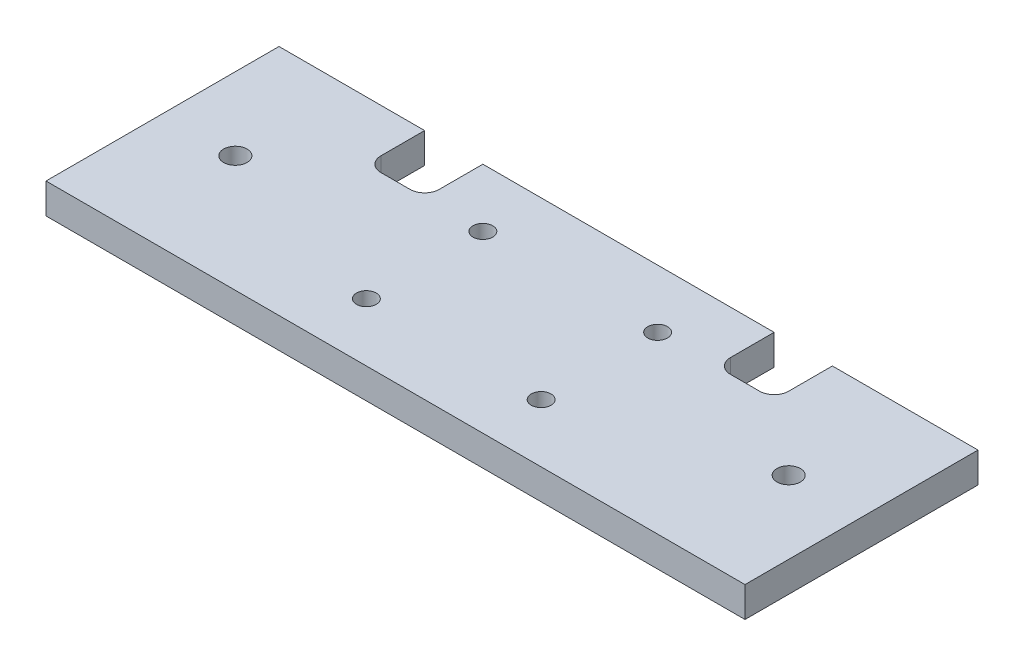
ISO-10303-21;
HEADER;
FILE_DESCRIPTION(('STEP AP214'),'2;1');
FILE_NAME('part.step','',(''),(''),'','','');
FILE_SCHEMA(('AUTOMOTIVE_DESIGN { 1 0 10303 214 1 1 1 1 }'));
ENDSEC;
DATA;
#1=APPLICATION_CONTEXT('core data for automotive mechanical design processes');
#2=APPLICATION_PROTOCOL_DEFINITION('international standard','automotive_design',2000,#1);
#3=PRODUCT_CONTEXT('',#1,'mechanical');
#4=PRODUCT('Part','Part','',(#3));
#5=PRODUCT_RELATED_PRODUCT_CATEGORY('part','',(#4));
#6=PRODUCT_DEFINITION_FORMATION('','',#4);
#7=PRODUCT_DEFINITION_CONTEXT('part definition',#1,'design');
#8=PRODUCT_DEFINITION('design','',#6,#7);
#9=PRODUCT_DEFINITION_SHAPE('','',#8);
#10=(LENGTH_UNIT() NAMED_UNIT(*) SI_UNIT(.MILLI.,.METRE.));
#11=(NAMED_UNIT(*) PLANE_ANGLE_UNIT() SI_UNIT($,.RADIAN.));
#12=(NAMED_UNIT(*) SI_UNIT($,.STERADIAN.) SOLID_ANGLE_UNIT());
#13=UNCERTAINTY_MEASURE_WITH_UNIT(LENGTH_MEASURE(1.E-05),#10,'distance_accuracy_value','');
#14=(GEOMETRIC_REPRESENTATION_CONTEXT(3) GLOBAL_UNCERTAINTY_ASSIGNED_CONTEXT((#13)) GLOBAL_UNIT_ASSIGNED_CONTEXT((#10,
#11,#12)) REPRESENTATION_CONTEXT('',''));
#15=CARTESIAN_POINT('',(0.,0.,0.));
#16=DIRECTION('',(0.,0.,1.));
#17=DIRECTION('',(1.,0.,0.));
#18=AXIS2_PLACEMENT_3D('',#15,#16,#17);
#19=CARTESIAN_POINT('',(-76.2,6.604,-25.4));
#20=DIRECTION('',(0.,0.,1.));
#21=DIRECTION('',(1.,0.,0.));
#22=AXIS2_PLACEMENT_3D('',#19,#20,#21);
#23=PLANE('',#22);
#24=DIRECTION('',(0.,1.,0.));
#25=VECTOR('',#24,1.);
#26=CARTESIAN_POINT('',(44.45,0.,-25.4));
#27=LINE('',#26,#25);
#28=CARTESIAN_POINT('',(44.45,0.,-25.4));
#29=VERTEX_POINT('',#28);
#30=CARTESIAN_POINT('',(44.45,6.604,-25.4));
#31=VERTEX_POINT('',#30);
#32=EDGE_CURVE('E148',#29,#31,#27,.T.);
#33=ORIENTED_EDGE('',*,*,#32,.T.);
#34=DIRECTION('',(-1.,0.,0.));
#35=VECTOR('',#34,1.);
#36=CARTESIAN_POINT('',(-76.2,6.604,-25.4));
#37=LINE('',#36,#35);
#38=CARTESIAN_POINT('',(76.2,6.604,-25.4));
#39=VERTEX_POINT('',#38);
#40=EDGE_CURVE('E200',#39,#31,#37,.T.);
#41=ORIENTED_EDGE('',*,*,#40,.F.);
#42=DIRECTION('',(0.,-1.,0.));
#43=VECTOR('',#42,1.);
#44=CARTESIAN_POINT('',(76.2,6.604,-25.4));
#45=LINE('',#44,#43);
#46=CARTESIAN_POINT('',(76.2,0.,-25.4));
#47=VERTEX_POINT('',#46);
#48=EDGE_CURVE('E175',#39,#47,#45,.T.);
#49=ORIENTED_EDGE('',*,*,#48,.T.);
#50=DIRECTION('',(-1.,0.,0.));
#51=VECTOR('',#50,1.);
#52=CARTESIAN_POINT('',(-76.2,0.,-25.4));
#53=LINE('',#52,#51);
#54=EDGE_CURVE('E168',#47,#29,#53,.T.);
#55=ORIENTED_EDGE('',*,*,#54,.T.);
#56=EDGE_LOOP('',(#33,#41,#49,#55));
#57=FACE_BOUND('',#56,.T.);
#58=ADVANCED_FACE('F34',(#57),#23,.F.);
#59=DIRECTION('',(0.,1.,0.));
#60=VECTOR('',#59,1.);
#61=CARTESIAN_POINT('',(31.75,0.,-25.4));
#62=LINE('',#61,#60);
#63=CARTESIAN_POINT('',(31.75,0.,-25.4));
#64=VERTEX_POINT('',#63);
#65=CARTESIAN_POINT('',(31.75,6.604,-25.4));
#66=VERTEX_POINT('',#65);
#67=EDGE_CURVE('E160',#64,#66,#62,.T.);
#68=ORIENTED_EDGE('',*,*,#67,.F.);
#69=CARTESIAN_POINT('',(-31.75,0.,-25.4));
#70=VERTEX_POINT('',#69);
#71=EDGE_CURVE('E177',#64,#70,#53,.T.);
#72=ORIENTED_EDGE('',*,*,#71,.T.);
#73=DIRECTION('',(0.,1.,0.));
#74=VECTOR('',#73,1.);
#75=CARTESIAN_POINT('',(-31.75,0.,-25.4));
#76=LINE('',#75,#74);
#77=CARTESIAN_POINT('',(-31.75,6.604,-25.4));
#78=VERTEX_POINT('',#77);
#79=EDGE_CURVE('E217',#70,#78,#76,.T.);
#80=ORIENTED_EDGE('',*,*,#79,.T.);
#81=EDGE_CURVE('E203',#66,#78,#37,.T.);
#82=ORIENTED_EDGE('',*,*,#81,.F.);
#83=EDGE_LOOP('',(#68,#72,#80,#82));
#84=FACE_BOUND('',#83,.T.);
#85=ADVANCED_FACE('F318',(#84),#23,.F.);
#86=CARTESIAN_POINT('',(0.,6.604,0.));
#87=DIRECTION('',(0.,1.,0.));
#88=DIRECTION('',(0.,0.,1.));
#89=AXIS2_PLACEMENT_3D('',#86,#87,#88);
#90=PLANE('',#89);
#91=CARTESIAN_POINT('',(-19.05,6.604,-12.7));
#92=DIRECTION('',(0.,1.,0.));
#93=DIRECTION('',(0.,0.,1.));
#94=AXIS2_PLACEMENT_3D('',#91,#92,#93);
#95=CIRCLE('',#94,2.15265);
#96=CARTESIAN_POINT('',(-19.05,6.604,-10.54735));
#97=VERTEX_POINT('',#96);
#98=EDGE_CURVE('E298',#97,#97,#95,.T.);
#99=ORIENTED_EDGE('',*,*,#98,.F.);
#100=EDGE_LOOP('',(#99));
#101=FACE_BOUND('',#100,.T.);
#102=CARTESIAN_POINT('',(-19.05,6.604,12.7));
#103=DIRECTION('',(0.,1.,0.));
#104=DIRECTION('',(0.,0.,1.));
#105=AXIS2_PLACEMENT_3D('',#102,#103,#104);
#106=CIRCLE('',#105,2.15265);
#107=CARTESIAN_POINT('',(-19.05,6.604,14.85265));
#108=VERTEX_POINT('',#107);
#109=EDGE_CURVE('E295',#108,#108,#106,.T.);
#110=ORIENTED_EDGE('',*,*,#109,.F.);
#111=EDGE_LOOP('',(#110));
#112=FACE_BOUND('',#111,.T.);
#113=CARTESIAN_POINT('',(19.05,6.604,-12.7));
#114=DIRECTION('',(0.,1.,0.));
#115=DIRECTION('',(0.,0.,1.));
#116=AXIS2_PLACEMENT_3D('',#113,#114,#115);
#117=CIRCLE('',#116,2.15265);
#118=CARTESIAN_POINT('',(19.05,6.604,-10.54735));
#119=VERTEX_POINT('',#118);
#120=EDGE_CURVE('E291',#119,#119,#117,.T.);
#121=ORIENTED_EDGE('',*,*,#120,.F.);
#122=EDGE_LOOP('',(#121));
#123=FACE_BOUND('',#122,.T.);
#124=CARTESIAN_POINT('',(19.05,6.604,12.7));
#125=DIRECTION('',(0.,1.,0.));
#126=DIRECTION('',(0.,0.,1.));
#127=AXIS2_PLACEMENT_3D('',#124,#125,#126);
#128=CIRCLE('',#127,2.15265);
#129=CARTESIAN_POINT('',(19.05,6.604,14.85265));
#130=VERTEX_POINT('',#129);
#131=EDGE_CURVE('E287',#130,#130,#128,.T.);
#132=ORIENTED_EDGE('',*,*,#131,.F.);
#133=EDGE_LOOP('',(#132));
#134=FACE_BOUND('',#133,.T.);
#135=CARTESIAN_POINT('',(-60.325,6.604,0.));
#136=DIRECTION('',(0.,1.,0.));
#137=DIRECTION('',(0.,0.,1.));
#138=AXIS2_PLACEMENT_3D('',#135,#136,#137);
#139=CIRCLE('',#138,2.5527);
#140=CARTESIAN_POINT('',(-60.325,6.604,2.5527));
#141=VERTEX_POINT('',#140);
#142=EDGE_CURVE('E281',#141,#141,#139,.T.);
#143=ORIENTED_EDGE('',*,*,#142,.F.);
#144=EDGE_LOOP('',(#143));
#145=FACE_BOUND('',#144,.T.);
#146=CARTESIAN_POINT('',(60.325,6.604,0.));
#147=DIRECTION('',(0.,1.,0.));
#148=DIRECTION('',(0.,0.,1.));
#149=AXIS2_PLACEMENT_3D('',#146,#147,#148);
#150=CIRCLE('',#149,2.5527);
#151=CARTESIAN_POINT('',(60.325,6.604,2.5527));
#152=VERTEX_POINT('',#151);
#153=EDGE_CURVE('E277',#152,#152,#150,.T.);
#154=ORIENTED_EDGE('',*,*,#153,.F.);
#155=EDGE_LOOP('',(#154));
#156=FACE_BOUND('',#155,.T.);
#157=ORIENTED_EDGE('',*,*,#40,.T.);
#158=DIRECTION('',(0.,0.,1.));
#159=VECTOR('',#158,1.);
#160=CARTESIAN_POINT('',(44.45,6.604,-25.4));
#161=LINE('',#160,#159);
#162=CARTESIAN_POINT('',(44.45,6.604,-15.875));
#163=VERTEX_POINT('',#162);
#164=EDGE_CURVE('E155',#31,#163,#161,.T.);
#165=ORIENTED_EDGE('',*,*,#164,.T.);
#166=CARTESIAN_POINT('',(41.275,6.604,-15.875));
#167=DIRECTION('',(0.,-1.,0.));
#168=DIRECTION('',(0.,0.,1.));
#169=AXIS2_PLACEMENT_3D('',#166,#167,#168);
#170=CIRCLE('',#169,3.175);
#171=CARTESIAN_POINT('',(41.275,6.604,-12.7));
#172=VERTEX_POINT('',#171);
#173=EDGE_CURVE('E171',#163,#172,#170,.T.);
#174=ORIENTED_EDGE('',*,*,#173,.T.);
#175=DIRECTION('',(-1.,0.,0.));
#176=VECTOR('',#175,1.);
#177=CARTESIAN_POINT('',(41.275,6.604,-12.7));
#178=LINE('',#177,#176);
#179=CARTESIAN_POINT('',(34.925,6.604,-12.7));
#180=VERTEX_POINT('',#179);
#181=EDGE_CURVE('E258',#172,#180,#178,.T.);
#182=ORIENTED_EDGE('',*,*,#181,.T.);
#183=CARTESIAN_POINT('',(34.925,6.604,-15.875));
#184=DIRECTION('',(0.,-1.,0.));
#185=DIRECTION('',(0.,0.,-1.));
#186=AXIS2_PLACEMENT_3D('',#183,#184,#185);
#187=CIRCLE('',#186,3.175);
#188=CARTESIAN_POINT('',(31.75,6.604,-15.875));
#189=VERTEX_POINT('',#188);
#190=EDGE_CURVE('E261',#180,#189,#187,.T.);
#191=ORIENTED_EDGE('',*,*,#190,.T.);
#192=DIRECTION('',(0.,0.,-1.));
#193=VECTOR('',#192,1.);
#194=CARTESIAN_POINT('',(31.75,6.604,-25.4));
#195=LINE('',#194,#193);
#196=EDGE_CURVE('E264',#189,#66,#195,.T.);
#197=ORIENTED_EDGE('',*,*,#196,.T.);
#198=ORIENTED_EDGE('',*,*,#81,.T.);
#199=DIRECTION('',(0.,0.,-1.));
#200=VECTOR('',#199,1.);
#201=CARTESIAN_POINT('',(-31.75,6.604,-25.4));
#202=LINE('',#201,#200);
#203=CARTESIAN_POINT('',(-31.75,6.604,-15.875));
#204=VERTEX_POINT('',#203);
#205=EDGE_CURVE('E221',#204,#78,#202,.T.);
#206=ORIENTED_EDGE('',*,*,#205,.F.);
#207=CARTESIAN_POINT('',(-34.925,6.604,-15.875));
#208=DIRECTION('',(0.,1.,0.));
#209=DIRECTION('',(0.,0.,-1.));
#210=AXIS2_PLACEMENT_3D('',#207,#208,#209);
#211=CIRCLE('',#210,3.175);
#212=CARTESIAN_POINT('',(-34.925,6.604,-12.7));
#213=VERTEX_POINT('',#212);
#214=EDGE_CURVE('E225',#213,#204,#211,.T.);
#215=ORIENTED_EDGE('',*,*,#214,.F.);
#216=DIRECTION('',(1.,0.,0.));
#217=VECTOR('',#216,1.);
#218=CARTESIAN_POINT('',(-41.275,6.604,-12.7));
#219=LINE('',#218,#217);
#220=CARTESIAN_POINT('',(-41.275,6.604,-12.7));
#221=VERTEX_POINT('',#220);
#222=EDGE_CURVE('E228',#221,#213,#219,.T.);
#223=ORIENTED_EDGE('',*,*,#222,.F.);
#224=CARTESIAN_POINT('',(-41.275,6.604,-15.875));
#225=DIRECTION('',(0.,1.,0.));
#226=DIRECTION('',(0.,0.,1.));
#227=AXIS2_PLACEMENT_3D('',#224,#225,#226);
#228=CIRCLE('',#227,3.175);
#229=CARTESIAN_POINT('',(-44.45,6.604,-15.875));
#230=VERTEX_POINT('',#229);
#231=EDGE_CURVE('E231',#230,#221,#228,.T.);
#232=ORIENTED_EDGE('',*,*,#231,.F.);
#233=DIRECTION('',(0.,0.,1.));
#234=VECTOR('',#233,1.);
#235=CARTESIAN_POINT('',(-44.45,6.604,-25.4));
#236=LINE('',#235,#234);
#237=CARTESIAN_POINT('',(-44.45,6.604,-25.4));
#238=VERTEX_POINT('',#237);
#239=EDGE_CURVE('E234',#238,#230,#236,.T.);
#240=ORIENTED_EDGE('',*,*,#239,.F.);
#241=CARTESIAN_POINT('',(-76.2,6.604,-25.4));
#242=VERTEX_POINT('',#241);
#243=EDGE_CURVE('E204',#238,#242,#37,.T.);
#244=ORIENTED_EDGE('',*,*,#243,.T.);
#245=DIRECTION('',(0.,0.,1.));
#246=VECTOR('',#245,1.);
#247=CARTESIAN_POINT('',(-76.2,6.604,-25.4));
#248=LINE('',#247,#246);
#249=CARTESIAN_POINT('',(-76.2,6.604,25.4));
#250=VERTEX_POINT('',#249);
#251=EDGE_CURVE('E176',#242,#250,#248,.T.);
#252=ORIENTED_EDGE('',*,*,#251,.T.);
#253=DIRECTION('',(1.,0.,0.));
#254=VECTOR('',#253,1.);
#255=CARTESIAN_POINT('',(-76.2,6.604,25.4));
#256=LINE('',#255,#254);
#257=CARTESIAN_POINT('',(76.2,6.604,25.4));
#258=VERTEX_POINT('',#257);
#259=EDGE_CURVE('E181',#250,#258,#256,.T.);
#260=ORIENTED_EDGE('',*,*,#259,.T.);
#261=DIRECTION('',(0.,0.,-1.));
#262=VECTOR('',#261,1.);
#263=CARTESIAN_POINT('',(76.2,6.604,-25.4));
#264=LINE('',#263,#262);
#265=EDGE_CURVE('E205',#258,#39,#264,.T.);
#266=ORIENTED_EDGE('',*,*,#265,.T.);
#267=EDGE_LOOP('',(#157,#165,#174,#182,#191,#197,#198,#206,#215,#223,#232,#240,#244,#252,#260,#266));
#268=FACE_BOUND('',#267,.T.);
#269=ADVANCED_FACE('F324',(#101,#112,#123,#134,#145,#156,#268),#90,.T.);
#270=CARTESIAN_POINT('',(0.,0.,0.));
#271=DIRECTION('',(0.,1.,0.));
#272=DIRECTION('',(0.,0.,1.));
#273=AXIS2_PLACEMENT_3D('',#270,#271,#272);
#274=PLANE('',#273);
#275=CARTESIAN_POINT('',(-19.05,0.,-12.7));
#276=DIRECTION('',(0.,1.,0.));
#277=DIRECTION('',(0.,0.,1.));
#278=AXIS2_PLACEMENT_3D('',#275,#276,#277);
#279=CIRCLE('',#278,2.15265);
#280=CARTESIAN_POINT('',(-19.05,0.,-10.54735));
#281=VERTEX_POINT('',#280);
#282=EDGE_CURVE('E38',#281,#281,#279,.T.);
#283=ORIENTED_EDGE('',*,*,#282,.T.);
#284=EDGE_LOOP('',(#283));
#285=FACE_BOUND('',#284,.T.);
#286=CARTESIAN_POINT('',(-19.05,0.,12.7));
#287=DIRECTION('',(0.,1.,0.));
#288=DIRECTION('',(0.,0.,1.));
#289=AXIS2_PLACEMENT_3D('',#286,#287,#288);
#290=CIRCLE('',#289,2.15265);
#291=CARTESIAN_POINT('',(-19.05,0.,14.85265));
#292=VERTEX_POINT('',#291);
#293=EDGE_CURVE('E294',#292,#292,#290,.T.);
#294=ORIENTED_EDGE('',*,*,#293,.T.);
#295=EDGE_LOOP('',(#294));
#296=FACE_BOUND('',#295,.T.);
#297=CARTESIAN_POINT('',(19.05,0.,-12.7));
#298=DIRECTION('',(0.,1.,0.));
#299=DIRECTION('',(0.,0.,1.));
#300=AXIS2_PLACEMENT_3D('',#297,#298,#299);
#301=CIRCLE('',#300,2.15265);
#302=CARTESIAN_POINT('',(19.05,0.,-10.54735));
#303=VERTEX_POINT('',#302);
#304=EDGE_CURVE('E290',#303,#303,#301,.T.);
#305=ORIENTED_EDGE('',*,*,#304,.T.);
#306=EDGE_LOOP('',(#305));
#307=FACE_BOUND('',#306,.T.);
#308=CARTESIAN_POINT('',(19.05,0.,12.7));
#309=DIRECTION('',(0.,1.,0.));
#310=DIRECTION('',(0.,0.,1.));
#311=AXIS2_PLACEMENT_3D('',#308,#309,#310);
#312=CIRCLE('',#311,2.15265);
#313=CARTESIAN_POINT('',(19.05,0.,14.85265));
#314=VERTEX_POINT('',#313);
#315=EDGE_CURVE('E284',#314,#314,#312,.T.);
#316=ORIENTED_EDGE('',*,*,#315,.T.);
#317=EDGE_LOOP('',(#316));
#318=FACE_BOUND('',#317,.T.);
#319=CARTESIAN_POINT('',(-60.325,0.,0.));
#320=DIRECTION('',(0.,1.,0.));
#321=DIRECTION('',(0.,0.,1.));
#322=AXIS2_PLACEMENT_3D('',#319,#320,#321);
#323=CIRCLE('',#322,2.5527);
#324=CARTESIAN_POINT('',(-60.325,0.,2.5527));
#325=VERTEX_POINT('',#324);
#326=EDGE_CURVE('E280',#325,#325,#323,.T.);
#327=ORIENTED_EDGE('',*,*,#326,.T.);
#328=EDGE_LOOP('',(#327));
#329=FACE_BOUND('',#328,.T.);
#330=CARTESIAN_POINT('',(60.325,0.,0.));
#331=DIRECTION('',(0.,1.,0.));
#332=DIRECTION('',(0.,0.,1.));
#333=AXIS2_PLACEMENT_3D('',#330,#331,#332);
#334=CIRCLE('',#333,2.5527);
#335=CARTESIAN_POINT('',(60.325,0.,2.5527));
#336=VERTEX_POINT('',#335);
#337=EDGE_CURVE('E268',#336,#336,#334,.T.);
#338=ORIENTED_EDGE('',*,*,#337,.T.);
#339=EDGE_LOOP('',(#338));
#340=FACE_BOUND('',#339,.T.);
#341=DIRECTION('',(0.,0.,1.));
#342=VECTOR('',#341,1.);
#343=CARTESIAN_POINT('',(44.45,0.,-25.4));
#344=LINE('',#343,#342);
#345=CARTESIAN_POINT('',(44.45,0.,-15.875));
#346=VERTEX_POINT('',#345);
#347=EDGE_CURVE('E152',#29,#346,#344,.T.);
#348=ORIENTED_EDGE('',*,*,#347,.F.);
#349=ORIENTED_EDGE('',*,*,#54,.F.);
#350=DIRECTION('',(0.,0.,-1.));
#351=VECTOR('',#350,1.);
#352=CARTESIAN_POINT('',(76.2,0.,-25.4));
#353=LINE('',#352,#351);
#354=CARTESIAN_POINT('',(76.2,0.,25.4));
#355=VERTEX_POINT('',#354);
#356=EDGE_CURVE('E185',#355,#47,#353,.T.);
#357=ORIENTED_EDGE('',*,*,#356,.F.);
#358=DIRECTION('',(1.,0.,0.));
#359=VECTOR('',#358,1.);
#360=CARTESIAN_POINT('',(-76.2,0.,25.4));
#361=LINE('',#360,#359);
#362=CARTESIAN_POINT('',(-76.2,0.,25.4));
#363=VERTEX_POINT('',#362);
#364=EDGE_CURVE('E191',#363,#355,#361,.T.);
#365=ORIENTED_EDGE('',*,*,#364,.F.);
#366=DIRECTION('',(0.,0.,1.));
#367=VECTOR('',#366,1.);
#368=CARTESIAN_POINT('',(-76.2,0.,-25.4));
#369=LINE('',#368,#367);
#370=CARTESIAN_POINT('',(-76.2,0.,-25.4));
#371=VERTEX_POINT('',#370);
#372=EDGE_CURVE('E194',#371,#363,#369,.T.);
#373=ORIENTED_EDGE('',*,*,#372,.F.);
#374=CARTESIAN_POINT('',(-44.45,0.,-25.4));
#375=VERTEX_POINT('',#374);
#376=EDGE_CURVE('E179',#375,#371,#53,.T.);
#377=ORIENTED_EDGE('',*,*,#376,.F.);
#378=DIRECTION('',(0.,0.,1.));
#379=VECTOR('',#378,1.);
#380=CARTESIAN_POINT('',(-44.45,0.,-25.4));
#381=LINE('',#380,#379);
#382=CARTESIAN_POINT('',(-44.45,0.,-15.875));
#383=VERTEX_POINT('',#382);
#384=EDGE_CURVE('E224',#375,#383,#381,.T.);
#385=ORIENTED_EDGE('',*,*,#384,.T.);
#386=CARTESIAN_POINT('',(-41.275,0.,-15.875));
#387=DIRECTION('',(0.,1.,0.));
#388=DIRECTION('',(0.,0.,1.));
#389=AXIS2_PLACEMENT_3D('',#386,#387,#388);
#390=CIRCLE('',#389,3.175);
#391=CARTESIAN_POINT('',(-41.275,0.,-12.7));
#392=VERTEX_POINT('',#391);
#393=EDGE_CURVE('E244',#383,#392,#390,.T.);
#394=ORIENTED_EDGE('',*,*,#393,.T.);
#395=DIRECTION('',(1.,0.,0.));
#396=VECTOR('',#395,1.);
#397=CARTESIAN_POINT('',(-41.275,0.,-12.7));
#398=LINE('',#397,#396);
#399=CARTESIAN_POINT('',(-34.925,0.,-12.7));
#400=VERTEX_POINT('',#399);
#401=EDGE_CURVE('E59',#392,#400,#398,.T.);
#402=ORIENTED_EDGE('',*,*,#401,.T.);
#403=CARTESIAN_POINT('',(-34.925,0.,-15.875));
#404=DIRECTION('',(0.,1.,0.));
#405=DIRECTION('',(0.,0.,-1.));
#406=AXIS2_PLACEMENT_3D('',#403,#404,#405);
#407=CIRCLE('',#406,3.175);
#408=CARTESIAN_POINT('',(-31.75,0.,-15.875));
#409=VERTEX_POINT('',#408);
#410=EDGE_CURVE('E240',#400,#409,#407,.T.);
#411=ORIENTED_EDGE('',*,*,#410,.T.);
#412=DIRECTION('',(0.,0.,-1.));
#413=VECTOR('',#412,1.);
#414=CARTESIAN_POINT('',(-31.75,0.,-25.4));
#415=LINE('',#414,#413);
#416=EDGE_CURVE('E211',#409,#70,#415,.T.);
#417=ORIENTED_EDGE('',*,*,#416,.T.);
#418=ORIENTED_EDGE('',*,*,#71,.F.);
#419=DIRECTION('',(0.,0.,-1.));
#420=VECTOR('',#419,1.);
#421=CARTESIAN_POINT('',(31.75,0.,-25.4));
#422=LINE('',#421,#420);
#423=CARTESIAN_POINT('',(31.75,0.,-15.875));
#424=VERTEX_POINT('',#423);
#425=EDGE_CURVE('E170',#424,#64,#422,.T.);
#426=ORIENTED_EDGE('',*,*,#425,.F.);
#427=CARTESIAN_POINT('',(34.925,0.,-15.875));
#428=DIRECTION('',(0.,-1.,0.));
#429=DIRECTION('',(0.,0.,-1.));
#430=AXIS2_PLACEMENT_3D('',#427,#428,#429);
#431=CIRCLE('',#430,3.175);
#432=CARTESIAN_POINT('',(34.925,0.,-12.7));
#433=VERTEX_POINT('',#432);
#434=EDGE_CURVE('E272',#433,#424,#431,.T.);
#435=ORIENTED_EDGE('',*,*,#434,.F.);
#436=DIRECTION('',(-1.,0.,0.));
#437=VECTOR('',#436,1.);
#438=CARTESIAN_POINT('',(41.275,0.,-12.7));
#439=LINE('',#438,#437);
#440=CARTESIAN_POINT('',(41.275,0.,-12.7));
#441=VERTEX_POINT('',#440);
#442=EDGE_CURVE('E270',#441,#433,#439,.T.);
#443=ORIENTED_EDGE('',*,*,#442,.F.);
#444=CARTESIAN_POINT('',(41.275,0.,-15.875));
#445=DIRECTION('',(0.,-1.,0.));
#446=DIRECTION('',(0.,0.,1.));
#447=AXIS2_PLACEMENT_3D('',#444,#445,#446);
#448=CIRCLE('',#447,3.175);
#449=EDGE_CURVE('E161',#346,#441,#448,.T.);
#450=ORIENTED_EDGE('',*,*,#449,.F.);
#451=EDGE_LOOP('',(#348,#349,#357,#365,#373,#377,#385,#394,#402,#411,#417,#418,#426,#435,#443,#450));
#452=FACE_BOUND('',#451,.T.);
#453=ADVANCED_FACE('F166',(#285,#296,#307,#318,#329,#340,#452),#274,.F.);
#454=ORIENTED_EDGE('',*,*,#243,.F.);
#455=DIRECTION('',(0.,1.,0.));
#456=VECTOR('',#455,1.);
#457=CARTESIAN_POINT('',(-44.45,0.,-25.4));
#458=LINE('',#457,#456);
#459=EDGE_CURVE('E199',#375,#238,#458,.T.);
#460=ORIENTED_EDGE('',*,*,#459,.F.);
#461=ORIENTED_EDGE('',*,*,#376,.T.);
#462=DIRECTION('',(0.,-1.,0.));
#463=VECTOR('',#462,1.);
#464=CARTESIAN_POINT('',(-76.2,6.604,-25.4));
#465=LINE('',#464,#463);
#466=EDGE_CURVE('E202',#242,#371,#465,.T.);
#467=ORIENTED_EDGE('',*,*,#466,.F.);
#468=EDGE_LOOP('',(#454,#460,#461,#467));
#469=FACE_BOUND('',#468,.T.);
#470=ADVANCED_FACE('F320',(#469),#23,.F.);
#471=CARTESIAN_POINT('',(-76.2,6.604,-25.4));
#472=DIRECTION('',(1.,0.,0.));
#473=DIRECTION('',(0.,0.,-1.));
#474=AXIS2_PLACEMENT_3D('',#471,#472,#473);
#475=PLANE('',#474);
#476=ORIENTED_EDGE('',*,*,#372,.T.);
#477=DIRECTION('',(0.,-1.,0.));
#478=VECTOR('',#477,1.);
#479=CARTESIAN_POINT('',(-76.2,6.604,25.4));
#480=LINE('',#479,#478);
#481=EDGE_CURVE('E11',#250,#363,#480,.T.);
#482=ORIENTED_EDGE('',*,*,#481,.F.);
#483=ORIENTED_EDGE('',*,*,#251,.F.);
#484=ORIENTED_EDGE('',*,*,#466,.T.);
#485=EDGE_LOOP('',(#476,#482,#483,#484));
#486=FACE_BOUND('',#485,.T.);
#487=ADVANCED_FACE('F36',(#486),#475,.F.);
#488=CARTESIAN_POINT('',(-76.2,6.604,25.4));
#489=DIRECTION('',(0.,0.,-1.));
#490=DIRECTION('',(-1.,0.,0.));
#491=AXIS2_PLACEMENT_3D('',#488,#489,#490);
#492=PLANE('',#491);
#493=ORIENTED_EDGE('',*,*,#364,.T.);
#494=DIRECTION('',(0.,-1.,0.));
#495=VECTOR('',#494,1.);
#496=CARTESIAN_POINT('',(76.2,6.604,25.4));
#497=LINE('',#496,#495);
#498=EDGE_CURVE('E43',#258,#355,#497,.T.);
#499=ORIENTED_EDGE('',*,*,#498,.F.);
#500=ORIENTED_EDGE('',*,*,#259,.F.);
#501=ORIENTED_EDGE('',*,*,#481,.T.);
#502=EDGE_LOOP('',(#493,#499,#500,#501));
#503=FACE_BOUND('',#502,.T.);
#504=ADVANCED_FACE('F333',(#503),#492,.F.);
#505=CARTESIAN_POINT('',(76.2,6.604,-25.4));
#506=DIRECTION('',(-1.,0.,0.));
#507=DIRECTION('',(0.,0.,1.));
#508=AXIS2_PLACEMENT_3D('',#505,#506,#507);
#509=PLANE('',#508);
#510=ORIENTED_EDGE('',*,*,#356,.T.);
#511=ORIENTED_EDGE('',*,*,#48,.F.);
#512=ORIENTED_EDGE('',*,*,#265,.F.);
#513=ORIENTED_EDGE('',*,*,#498,.T.);
#514=EDGE_LOOP('',(#510,#511,#512,#513));
#515=FACE_BOUND('',#514,.T.);
#516=ADVANCED_FACE('F421',(#515),#509,.F.);
#517=CARTESIAN_POINT('',(-44.45,0.,-25.4));
#518=DIRECTION('',(-1.,0.,0.));
#519=DIRECTION('',(0.,0.,1.));
#520=AXIS2_PLACEMENT_3D('',#517,#518,#519);
#521=PLANE('',#520);
#522=ORIENTED_EDGE('',*,*,#239,.T.);
#523=DIRECTION('',(0.,1.,0.));
#524=VECTOR('',#523,1.);
#525=CARTESIAN_POINT('',(-44.45,0.,-15.875));
#526=LINE('',#525,#524);
#527=EDGE_CURVE('E208',#383,#230,#526,.T.);
#528=ORIENTED_EDGE('',*,*,#527,.F.);
#529=ORIENTED_EDGE('',*,*,#384,.F.);
#530=ORIENTED_EDGE('',*,*,#459,.T.);
#531=EDGE_LOOP('',(#522,#528,#529,#530));
#532=FACE_BOUND('',#531,.T.);
#533=ADVANCED_FACE('F360',(#532),#521,.F.);
#534=CARTESIAN_POINT('',(-31.75,0.,-25.4));
#535=DIRECTION('',(1.,0.,0.));
#536=DIRECTION('',(0.,0.,-1.));
#537=AXIS2_PLACEMENT_3D('',#534,#535,#536);
#538=PLANE('',#537);
#539=ORIENTED_EDGE('',*,*,#205,.T.);
#540=ORIENTED_EDGE('',*,*,#79,.F.);
#541=ORIENTED_EDGE('',*,*,#416,.F.);
#542=DIRECTION('',(0.,1.,0.));
#543=VECTOR('',#542,1.);
#544=CARTESIAN_POINT('',(-31.75,0.,-15.875));
#545=LINE('',#544,#543);
#546=EDGE_CURVE('E215',#409,#204,#545,.T.);
#547=ORIENTED_EDGE('',*,*,#546,.T.);
#548=EDGE_LOOP('',(#539,#540,#541,#547));
#549=FACE_BOUND('',#548,.T.);
#550=ADVANCED_FACE('F345',(#549),#538,.F.);
#551=CARTESIAN_POINT('',(-34.925,0.,-15.875));
#552=DIRECTION('',(0.,1.,0.));
#553=DIRECTION('',(0.,0.,1.));
#554=AXIS2_PLACEMENT_3D('',#551,#552,#553);
#555=CYLINDRICAL_SURFACE('',#554,3.175);
#556=ORIENTED_EDGE('',*,*,#214,.T.);
#557=ORIENTED_EDGE('',*,*,#546,.F.);
#558=ORIENTED_EDGE('',*,*,#410,.F.);
#559=DIRECTION('',(0.,1.,0.));
#560=VECTOR('',#559,1.);
#561=CARTESIAN_POINT('',(-34.925,0.,-12.7));
#562=LINE('',#561,#560);
#563=EDGE_CURVE('E213',#400,#213,#562,.T.);
#564=ORIENTED_EDGE('',*,*,#563,.T.);
#565=EDGE_LOOP('',(#556,#557,#558,#564));
#566=FACE_BOUND('',#565,.T.);
#567=ADVANCED_FACE('F352',(#566),#555,.F.);
#568=CARTESIAN_POINT('',(-41.275,0.,-12.7));
#569=DIRECTION('',(0.,0.,1.));
#570=DIRECTION('',(1.,0.,0.));
#571=AXIS2_PLACEMENT_3D('',#568,#569,#570);
#572=PLANE('',#571);
#573=ORIENTED_EDGE('',*,*,#222,.T.);
#574=ORIENTED_EDGE('',*,*,#563,.F.);
#575=ORIENTED_EDGE('',*,*,#401,.F.);
#576=DIRECTION('',(0.,1.,0.));
#577=VECTOR('',#576,1.);
#578=CARTESIAN_POINT('',(-41.275,0.,-12.7));
#579=LINE('',#578,#577);
#580=EDGE_CURVE('E210',#392,#221,#579,.T.);
#581=ORIENTED_EDGE('',*,*,#580,.T.);
#582=EDGE_LOOP('',(#573,#574,#575,#581));
#583=FACE_BOUND('',#582,.T.);
#584=ADVANCED_FACE('F355',(#583),#572,.F.);
#585=CARTESIAN_POINT('',(-41.275,0.,-15.875));
#586=DIRECTION('',(0.,1.,0.));
#587=DIRECTION('',(0.,0.,1.));
#588=AXIS2_PLACEMENT_3D('',#585,#586,#587);
#589=CYLINDRICAL_SURFACE('',#588,3.175);
#590=ORIENTED_EDGE('',*,*,#231,.T.);
#591=ORIENTED_EDGE('',*,*,#580,.F.);
#592=ORIENTED_EDGE('',*,*,#393,.F.);
#593=ORIENTED_EDGE('',*,*,#527,.T.);
#594=EDGE_LOOP('',(#590,#591,#592,#593));
#595=FACE_BOUND('',#594,.T.);
#596=ADVANCED_FACE('F358',(#595),#589,.F.);
#597=CARTESIAN_POINT('',(44.45,0.,-25.4));
#598=DIRECTION('',(-1.,0.,0.));
#599=DIRECTION('',(0.,0.,1.));
#600=AXIS2_PLACEMENT_3D('',#597,#598,#599);
#601=PLANE('',#600);
#602=ORIENTED_EDGE('',*,*,#164,.F.);
#603=ORIENTED_EDGE('',*,*,#32,.F.);
#604=ORIENTED_EDGE('',*,*,#347,.T.);
#605=DIRECTION('',(0.,1.,0.));
#606=VECTOR('',#605,1.);
#607=CARTESIAN_POINT('',(44.45,0.,-15.875));
#608=LINE('',#607,#606);
#609=EDGE_CURVE('E237',#346,#163,#608,.T.);
#610=ORIENTED_EDGE('',*,*,#609,.T.);
#611=EDGE_LOOP('',(#602,#603,#604,#610));
#612=FACE_BOUND('',#611,.T.);
#613=ADVANCED_FACE('F150',(#612),#601,.T.);
#614=CARTESIAN_POINT('',(41.275,0.,-15.875));
#615=DIRECTION('',(0.,1.,0.));
#616=DIRECTION('',(0.,0.,1.));
#617=AXIS2_PLACEMENT_3D('',#614,#615,#616);
#618=CYLINDRICAL_SURFACE('',#617,3.175);
#619=ORIENTED_EDGE('',*,*,#173,.F.);
#620=ORIENTED_EDGE('',*,*,#609,.F.);
#621=ORIENTED_EDGE('',*,*,#449,.T.);
#622=DIRECTION('',(0.,1.,0.));
#623=VECTOR('',#622,1.);
#624=CARTESIAN_POINT('',(41.275,0.,-12.7));
#625=LINE('',#624,#623);
#626=EDGE_CURVE('E253',#441,#172,#625,.T.);
#627=ORIENTED_EDGE('',*,*,#626,.T.);
#628=EDGE_LOOP('',(#619,#620,#621,#627));
#629=FACE_BOUND('',#628,.T.);
#630=ADVANCED_FACE('F398',(#629),#618,.F.);
#631=CARTESIAN_POINT('',(41.275,0.,-12.7));
#632=DIRECTION('',(0.,0.,-1.));
#633=DIRECTION('',(-1.,0.,0.));
#634=AXIS2_PLACEMENT_3D('',#631,#632,#633);
#635=PLANE('',#634);
#636=ORIENTED_EDGE('',*,*,#181,.F.);
#637=ORIENTED_EDGE('',*,*,#626,.F.);
#638=ORIENTED_EDGE('',*,*,#442,.T.);
#639=DIRECTION('',(0.,1.,0.));
#640=VECTOR('',#639,1.);
#641=CARTESIAN_POINT('',(34.925,0.,-12.7));
#642=LINE('',#641,#640);
#643=EDGE_CURVE('E251',#433,#180,#642,.T.);
#644=ORIENTED_EDGE('',*,*,#643,.T.);
#645=EDGE_LOOP('',(#636,#637,#638,#644));
#646=FACE_BOUND('',#645,.T.);
#647=ADVANCED_FACE('F401',(#646),#635,.T.);
#648=CARTESIAN_POINT('',(34.925,0.,-15.875));
#649=DIRECTION('',(0.,1.,0.));
#650=DIRECTION('',(0.,0.,1.));
#651=AXIS2_PLACEMENT_3D('',#648,#649,#650);
#652=CYLINDRICAL_SURFACE('',#651,3.175);
#653=ORIENTED_EDGE('',*,*,#190,.F.);
#654=ORIENTED_EDGE('',*,*,#643,.F.);
#655=ORIENTED_EDGE('',*,*,#434,.T.);
#656=DIRECTION('',(0.,1.,0.));
#657=VECTOR('',#656,1.);
#658=CARTESIAN_POINT('',(31.75,0.,-15.875));
#659=LINE('',#658,#657);
#660=EDGE_CURVE('E51',#424,#189,#659,.T.);
#661=ORIENTED_EDGE('',*,*,#660,.T.);
#662=EDGE_LOOP('',(#653,#654,#655,#661));
#663=FACE_BOUND('',#662,.T.);
#664=ADVANCED_FACE('F394',(#663),#652,.F.);
#665=CARTESIAN_POINT('',(31.75,0.,-25.4));
#666=DIRECTION('',(1.,0.,0.));
#667=DIRECTION('',(0.,0.,-1.));
#668=AXIS2_PLACEMENT_3D('',#665,#666,#667);
#669=PLANE('',#668);
#670=ORIENTED_EDGE('',*,*,#196,.F.);
#671=ORIENTED_EDGE('',*,*,#660,.F.);
#672=ORIENTED_EDGE('',*,*,#425,.T.);
#673=ORIENTED_EDGE('',*,*,#67,.T.);
#674=EDGE_LOOP('',(#670,#671,#672,#673));
#675=FACE_BOUND('',#674,.T.);
#676=ADVANCED_FACE('F384',(#675),#669,.T.);
#677=CARTESIAN_POINT('',(60.325,6.604,0.));
#678=DIRECTION('',(0.,1.,0.));
#679=DIRECTION('',(0.,0.,1.));
#680=AXIS2_PLACEMENT_3D('',#677,#678,#679);
#681=CYLINDRICAL_SURFACE('',#680,2.5527);
#682=ORIENTED_EDGE('',*,*,#153,.T.);
#683=EDGE_LOOP('',(#682));
#684=FACE_BOUND('',#683,.T.);
#685=ORIENTED_EDGE('',*,*,#337,.F.);
#686=EDGE_LOOP('',(#685));
#687=FACE_BOUND('',#686,.T.);
#688=ADVANCED_FACE('F381',(#684,#687),#681,.F.);
#689=CARTESIAN_POINT('',(-60.325,6.604,0.));
#690=DIRECTION('',(0.,1.,0.));
#691=DIRECTION('',(0.,0.,1.));
#692=AXIS2_PLACEMENT_3D('',#689,#690,#691);
#693=CYLINDRICAL_SURFACE('',#692,2.5527);
#694=ORIENTED_EDGE('',*,*,#142,.T.);
#695=EDGE_LOOP('',(#694));
#696=FACE_BOUND('',#695,.T.);
#697=ORIENTED_EDGE('',*,*,#326,.F.);
#698=EDGE_LOOP('',(#697));
#699=FACE_BOUND('',#698,.T.);
#700=ADVANCED_FACE('F383',(#696,#699),#693,.F.);
#701=CARTESIAN_POINT('',(19.05,6.604,12.7));
#702=DIRECTION('',(0.,1.,0.));
#703=DIRECTION('',(0.,0.,1.));
#704=AXIS2_PLACEMENT_3D('',#701,#702,#703);
#705=CYLINDRICAL_SURFACE('',#704,2.15265);
#706=ORIENTED_EDGE('',*,*,#131,.T.);
#707=EDGE_LOOP('',(#706));
#708=FACE_BOUND('',#707,.T.);
#709=ORIENTED_EDGE('',*,*,#315,.F.);
#710=EDGE_LOOP('',(#709));
#711=FACE_BOUND('',#710,.T.);
#712=ADVANCED_FACE('F391',(#708,#711),#705,.F.);
#713=CARTESIAN_POINT('',(19.05,6.604,-12.7));
#714=DIRECTION('',(0.,1.,0.));
#715=DIRECTION('',(0.,0.,1.));
#716=AXIS2_PLACEMENT_3D('',#713,#714,#715);
#717=CYLINDRICAL_SURFACE('',#716,2.15265);
#718=ORIENTED_EDGE('',*,*,#120,.T.);
#719=EDGE_LOOP('',(#718));
#720=FACE_BOUND('',#719,.T.);
#721=ORIENTED_EDGE('',*,*,#304,.F.);
#722=EDGE_LOOP('',(#721));
#723=FACE_BOUND('',#722,.T.);
#724=ADVANCED_FACE('F314',(#720,#723),#717,.F.);
#725=CARTESIAN_POINT('',(-19.05,6.604,12.7));
#726=DIRECTION('',(0.,1.,0.));
#727=DIRECTION('',(0.,0.,1.));
#728=AXIS2_PLACEMENT_3D('',#725,#726,#727);
#729=CYLINDRICAL_SURFACE('',#728,2.15265);
#730=ORIENTED_EDGE('',*,*,#109,.T.);
#731=EDGE_LOOP('',(#730));
#732=FACE_BOUND('',#731,.T.);
#733=ORIENTED_EDGE('',*,*,#293,.F.);
#734=EDGE_LOOP('',(#733));
#735=FACE_BOUND('',#734,.T.);
#736=ADVANCED_FACE('F309',(#732,#735),#729,.F.);
#737=CARTESIAN_POINT('',(-19.05,6.604,-12.7));
#738=DIRECTION('',(0.,1.,0.));
#739=DIRECTION('',(0.,0.,1.));
#740=AXIS2_PLACEMENT_3D('',#737,#738,#739);
#741=CYLINDRICAL_SURFACE('',#740,2.15265);
#742=ORIENTED_EDGE('',*,*,#98,.T.);
#743=EDGE_LOOP('',(#742));
#744=FACE_BOUND('',#743,.T.);
#745=ORIENTED_EDGE('',*,*,#282,.F.);
#746=EDGE_LOOP('',(#745));
#747=FACE_BOUND('',#746,.T.);
#748=ADVANCED_FACE('F307',(#744,#747),#741,.F.);
#749=CLOSED_SHELL('',(#58,#85,#269,#453,#470,#487,#504,#516,#533,#550,#567,#584,#596,#613,#630,
#647,#664,#676,#688,#700,#712,#724,#736,#748));
#750=MANIFOLD_SOLID_BREP('B2',#749);
#751=ADVANCED_BREP_SHAPE_REPRESENTATION('',(#18,#750),#14);
#752=SHAPE_DEFINITION_REPRESENTATION(#9,#751);
ENDSEC;
END-ISO-10303-21;
